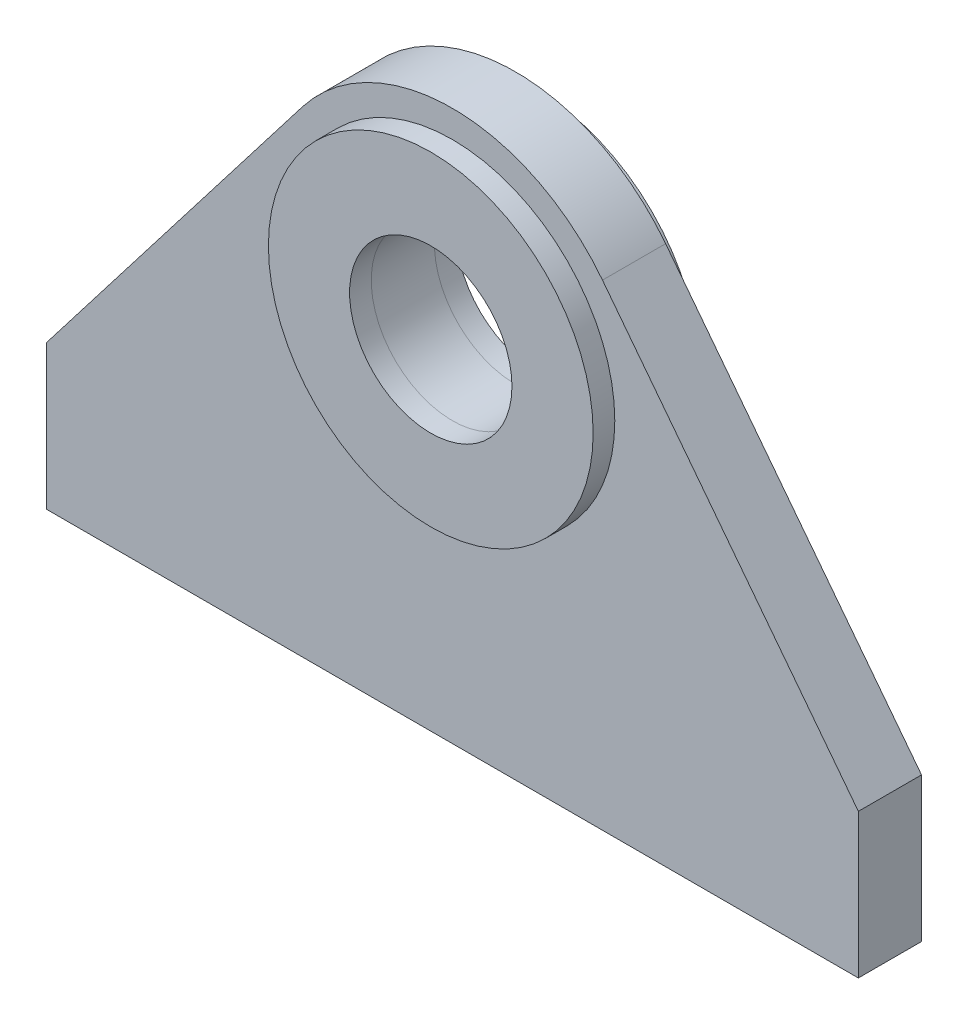
ISO-10303-21;
HEADER;
FILE_DESCRIPTION(('STEP AP214'),'2;1');
FILE_NAME('part.step','',(''),(''),'','','');
FILE_SCHEMA(('AUTOMOTIVE_DESIGN { 1 0 10303 214 1 1 1 1 }'));
ENDSEC;
DATA;
#1=APPLICATION_CONTEXT('core data for automotive mechanical design processes');
#2=APPLICATION_PROTOCOL_DEFINITION('international standard','automotive_design',2000,#1);
#3=PRODUCT_CONTEXT('',#1,'mechanical');
#4=PRODUCT('Part','Part','',(#3));
#5=PRODUCT_RELATED_PRODUCT_CATEGORY('part','',(#4));
#6=PRODUCT_DEFINITION_FORMATION('','',#4);
#7=PRODUCT_DEFINITION_CONTEXT('part definition',#1,'design');
#8=PRODUCT_DEFINITION('design','',#6,#7);
#9=PRODUCT_DEFINITION_SHAPE('','',#8);
#10=(LENGTH_UNIT() NAMED_UNIT(*) SI_UNIT(.MILLI.,.METRE.));
#11=(NAMED_UNIT(*) PLANE_ANGLE_UNIT() SI_UNIT($,.RADIAN.));
#12=(NAMED_UNIT(*) SI_UNIT($,.STERADIAN.) SOLID_ANGLE_UNIT());
#13=UNCERTAINTY_MEASURE_WITH_UNIT(LENGTH_MEASURE(1.E-05),#10,'distance_accuracy_value','');
#14=(GEOMETRIC_REPRESENTATION_CONTEXT(3) GLOBAL_UNCERTAINTY_ASSIGNED_CONTEXT((#13)) GLOBAL_UNIT_ASSIGNED_CONTEXT((#10,
#11,#12)) REPRESENTATION_CONTEXT('',''));
#15=CARTESIAN_POINT('',(0.,0.,0.));
#16=DIRECTION('',(0.,0.,1.));
#17=DIRECTION('',(1.,0.,0.));
#18=AXIS2_PLACEMENT_3D('',#15,#16,#17);
#19=CARTESIAN_POINT('',(0.,200.,-29.5));
#20=DIRECTION('',(0.,0.,-1.));
#21=DIRECTION('',(1.,0.,0.));
#22=AXIS2_PLACEMENT_3D('',#19,#20,#21);
#23=PLANE('',#22);
#24=CARTESIAN_POINT('',(0.,200.,-29.5));
#25=DIRECTION('',(0.,0.,1.));
#26=DIRECTION('',(1.,0.,0.));
#27=AXIS2_PLACEMENT_3D('',#24,#25,#26);
#28=CIRCLE('',#27,90.0000000000001);
#29=CARTESIAN_POINT('',(90.0000000000001,200.,-29.5));
#30=VERTEX_POINT('',#29);
#31=EDGE_CURVE('E11',#30,#30,#28,.T.);
#32=ORIENTED_EDGE('',*,*,#31,.F.);
#33=EDGE_LOOP('',(#32));
#34=FACE_BOUND('',#33,.T.);
#35=CARTESIAN_POINT('',(0.,200.,-29.5));
#36=DIRECTION('',(0.,0.,1.));
#37=DIRECTION('',(1.,0.,0.));
#38=AXIS2_PLACEMENT_3D('',#35,#36,#37);
#39=CIRCLE('',#38,45.);
#40=CARTESIAN_POINT('',(45.,200.,-29.5));
#41=VERTEX_POINT('',#40);
#42=EDGE_CURVE('E53',#41,#41,#39,.T.);
#43=ORIENTED_EDGE('',*,*,#42,.T.);
#44=EDGE_LOOP('',(#43));
#45=FACE_BOUND('',#44,.T.);
#46=ADVANCED_FACE('F42',(#34,#45),#23,.T.);
#47=CARTESIAN_POINT('',(0.,200.,-17.5));
#48=DIRECTION('',(0.,0.,-1.));
#49=DIRECTION('',(1.,0.,0.));
#50=AXIS2_PLACEMENT_3D('',#47,#48,#49);
#51=PLANE('',#50);
#52=CARTESIAN_POINT('',(0.,200.,-17.5));
#53=DIRECTION('',(0.,0.,1.));
#54=DIRECTION('',(1.,0.,0.));
#55=AXIS2_PLACEMENT_3D('',#52,#53,#54);
#56=CIRCLE('',#55,90.0000000000001);
#57=CARTESIAN_POINT('',(90.0000000000001,200.,-17.5));
#58=VERTEX_POINT('',#57);
#59=EDGE_CURVE('E46',#58,#58,#56,.T.);
#60=ORIENTED_EDGE('',*,*,#59,.T.);
#61=EDGE_LOOP('',(#60));
#62=FACE_BOUND('',#61,.T.);
#63=CARTESIAN_POINT('',(0.,200.,-17.5));
#64=DIRECTION('',(0.,0.,1.));
#65=DIRECTION('',(1.,0.,0.));
#66=AXIS2_PLACEMENT_3D('',#63,#64,#65);
#67=CIRCLE('',#66,45.);
#68=CARTESIAN_POINT('',(45.,200.,-17.5));
#69=VERTEX_POINT('',#68);
#70=EDGE_CURVE('E55',#69,#69,#67,.T.);
#71=ORIENTED_EDGE('',*,*,#70,.F.);
#72=EDGE_LOOP('',(#71));
#73=FACE_BOUND('',#72,.T.);
#74=ADVANCED_FACE('F68',(#62,#73),#51,.F.);
#75=CARTESIAN_POINT('',(0.,200.,-29.5));
#76=DIRECTION('',(0.,0.,1.));
#77=DIRECTION('',(-1.,0.,0.));
#78=AXIS2_PLACEMENT_3D('',#75,#76,#77);
#79=CYLINDRICAL_SURFACE('',#78,90.0000000000001);
#80=ORIENTED_EDGE('',*,*,#31,.T.);
#81=EDGE_LOOP('',(#80));
#82=FACE_BOUND('',#81,.T.);
#83=ORIENTED_EDGE('',*,*,#59,.F.);
#84=EDGE_LOOP('',(#83));
#85=FACE_BOUND('',#84,.T.);
#86=ADVANCED_FACE('F44',(#82,#85),#79,.T.);
#87=CARTESIAN_POINT('',(0.,200.,-29.5));
#88=DIRECTION('',(0.,0.,1.));
#89=DIRECTION('',(-1.,0.,0.));
#90=AXIS2_PLACEMENT_3D('',#87,#88,#89);
#91=CYLINDRICAL_SURFACE('',#90,45.);
#92=ORIENTED_EDGE('',*,*,#42,.F.);
#93=EDGE_LOOP('',(#92));
#94=FACE_BOUND('',#93,.T.);
#95=ORIENTED_EDGE('',*,*,#70,.T.);
#96=EDGE_LOOP('',(#95));
#97=FACE_BOUND('',#96,.T.);
#98=ADVANCED_FACE('F62',(#94,#97),#91,.F.);
#99=CLOSED_SHELL('',(#46,#74,#86,#98));
#100=MANIFOLD_SOLID_BREP('B2',#99);
#101=CARTESIAN_POINT('',(0.,200.,29.5));
#102=DIRECTION('',(0.,0.,1.));
#103=DIRECTION('',(1.,0.,0.));
#104=AXIS2_PLACEMENT_3D('',#101,#102,#103);
#105=PLANE('',#104);
#106=CARTESIAN_POINT('',(0.,200.,29.5));
#107=DIRECTION('',(0.,0.,1.));
#108=DIRECTION('',(1.,0.,0.));
#109=AXIS2_PLACEMENT_3D('',#106,#107,#108);
#110=CIRCLE('',#109,90.0000000000001);
#111=CARTESIAN_POINT('',(90.0000000000001,200.,29.5));
#112=VERTEX_POINT('',#111);
#113=EDGE_CURVE('E41',#112,#112,#110,.T.);
#114=ORIENTED_EDGE('',*,*,#113,.T.);
#115=EDGE_LOOP('',(#114));
#116=FACE_BOUND('',#115,.T.);
#117=CARTESIAN_POINT('',(0.,200.,29.5));
#118=DIRECTION('',(0.,0.,1.));
#119=DIRECTION('',(1.,0.,0.));
#120=AXIS2_PLACEMENT_3D('',#117,#118,#119);
#121=CIRCLE('',#120,45.);
#122=CARTESIAN_POINT('',(45.,200.,29.5));
#123=VERTEX_POINT('',#122);
#124=EDGE_CURVE('E124',#123,#123,#121,.T.);
#125=ORIENTED_EDGE('',*,*,#124,.F.);
#126=EDGE_LOOP('',(#125));
#127=FACE_BOUND('',#126,.T.);
#128=ADVANCED_FACE('F113',(#116,#127),#105,.T.);
#129=CARTESIAN_POINT('',(0.,200.,17.5));
#130=DIRECTION('',(0.,0.,1.));
#131=DIRECTION('',(1.,0.,0.));
#132=AXIS2_PLACEMENT_3D('',#129,#130,#131);
#133=PLANE('',#132);
#134=CARTESIAN_POINT('',(0.,200.,17.5));
#135=DIRECTION('',(0.,0.,1.));
#136=DIRECTION('',(1.,0.,0.));
#137=AXIS2_PLACEMENT_3D('',#134,#135,#136);
#138=CIRCLE('',#137,90.0000000000001);
#139=CARTESIAN_POINT('',(90.0000000000001,200.,17.5));
#140=VERTEX_POINT('',#139);
#141=EDGE_CURVE('E117',#140,#140,#138,.T.);
#142=ORIENTED_EDGE('',*,*,#141,.F.);
#143=EDGE_LOOP('',(#142));
#144=FACE_BOUND('',#143,.T.);
#145=CARTESIAN_POINT('',(0.,200.,17.5));
#146=DIRECTION('',(0.,0.,1.));
#147=DIRECTION('',(1.,0.,0.));
#148=AXIS2_PLACEMENT_3D('',#145,#146,#147);
#149=CIRCLE('',#148,45.);
#150=CARTESIAN_POINT('',(45.,200.,17.5));
#151=VERTEX_POINT('',#150);
#152=EDGE_CURVE('E126',#151,#151,#149,.T.);
#153=ORIENTED_EDGE('',*,*,#152,.T.);
#154=EDGE_LOOP('',(#153));
#155=FACE_BOUND('',#154,.T.);
#156=ADVANCED_FACE('F136',(#144,#155),#133,.F.);
#157=CARTESIAN_POINT('',(0.,200.,29.5));
#158=DIRECTION('',(0.,0.,-1.));
#159=DIRECTION('',(-1.,0.,0.));
#160=AXIS2_PLACEMENT_3D('',#157,#158,#159);
#161=CYLINDRICAL_SURFACE('',#160,90.0000000000001);
#162=ORIENTED_EDGE('',*,*,#113,.F.);
#163=EDGE_LOOP('',(#162));
#164=FACE_BOUND('',#163,.T.);
#165=ORIENTED_EDGE('',*,*,#141,.T.);
#166=EDGE_LOOP('',(#165));
#167=FACE_BOUND('',#166,.T.);
#168=ADVANCED_FACE('F115',(#164,#167),#161,.T.);
#169=CARTESIAN_POINT('',(0.,200.,29.5));
#170=DIRECTION('',(0.,0.,-1.));
#171=DIRECTION('',(-1.,0.,0.));
#172=AXIS2_PLACEMENT_3D('',#169,#170,#171);
#173=CYLINDRICAL_SURFACE('',#172,45.);
#174=ORIENTED_EDGE('',*,*,#124,.T.);
#175=EDGE_LOOP('',(#174));
#176=FACE_BOUND('',#175,.T.);
#177=ORIENTED_EDGE('',*,*,#152,.F.);
#178=EDGE_LOOP('',(#177));
#179=FACE_BOUND('',#178,.T.);
#180=ADVANCED_FACE('F132',(#176,#179),#173,.F.);
#181=CLOSED_SHELL('',(#128,#156,#168,#180));
#182=MANIFOLD_SOLID_BREP('B6',#181);
#183=CARTESIAN_POINT('',(0.,200.,17.5));
#184=DIRECTION('',(0.,0.,1.));
#185=DIRECTION('',(1.,0.,0.));
#186=AXIS2_PLACEMENT_3D('',#183,#184,#185);
#187=PLANE('',#186);
#188=DIRECTION('',(0.,-1.,0.));
#189=VECTOR('',#188,1.);
#190=CARTESIAN_POINT('',(-225.,0.,17.5));
#191=LINE('',#190,#189);
#192=CARTESIAN_POINT('',(-225.,80.,17.5));
#193=VERTEX_POINT('',#192);
#194=CARTESIAN_POINT('',(-225.,0.,17.5));
#195=VERTEX_POINT('',#194);
#196=EDGE_CURVE('E270',#193,#195,#191,.T.);
#197=ORIENTED_EDGE('',*,*,#196,.T.);
#198=DIRECTION('',(1.,0.,0.));
#199=VECTOR('',#198,1.);
#200=CARTESIAN_POINT('',(-225.,0.,17.5));
#201=LINE('',#200,#199);
#202=CARTESIAN_POINT('',(225.,0.,17.5));
#203=VERTEX_POINT('',#202);
#204=EDGE_CURVE('E228',#195,#203,#201,.T.);
#205=ORIENTED_EDGE('',*,*,#204,.T.);
#206=DIRECTION('',(0.,1.,0.));
#207=VECTOR('',#206,1.);
#208=CARTESIAN_POINT('',(225.,0.,17.5));
#209=LINE('',#208,#207);
#210=CARTESIAN_POINT('',(225.,80.,17.5));
#211=VERTEX_POINT('',#210);
#212=EDGE_CURVE('E241',#203,#211,#209,.T.);
#213=ORIENTED_EDGE('',*,*,#212,.T.);
#214=DIRECTION('',(-0.610307961150329,0.792164245946842,0.));
#215=VECTOR('',#214,1.);
#216=CARTESIAN_POINT('',(225.,80.,17.5));
#217=LINE('',#216,#215);
#218=CARTESIAN_POINT('',(83.1772458244184,264.082335920785,17.5));
#219=VERTEX_POINT('',#218);
#220=EDGE_CURVE('E235',#211,#219,#217,.T.);
#221=ORIENTED_EDGE('',*,*,#220,.T.);
#222=CARTESIAN_POINT('',(0.,200.,17.5));
#223=DIRECTION('',(0.,0.,1.));
#224=DIRECTION('',(1.,0.,0.));
#225=AXIS2_PLACEMENT_3D('',#222,#223,#224);
#226=CIRCLE('',#225,105.);
#227=CARTESIAN_POINT('',(-83.1772458244184,264.082335920785,17.5));
#228=VERTEX_POINT('',#227);
#229=EDGE_CURVE('E239',#219,#228,#226,.T.);
#230=ORIENTED_EDGE('',*,*,#229,.T.);
#231=DIRECTION('',(-0.610307961150329,-0.792164245946842,0.));
#232=VECTOR('',#231,1.);
#233=CARTESIAN_POINT('',(-225.,80.,17.5));
#234=LINE('',#233,#232);
#235=EDGE_CURVE('E191',#228,#193,#234,.T.);
#236=ORIENTED_EDGE('',*,*,#235,.T.);
#237=EDGE_LOOP('',(#197,#205,#213,#221,#230,#236));
#238=FACE_BOUND('',#237,.T.);
#239=CARTESIAN_POINT('',(0.,200.,17.5));
#240=DIRECTION('',(0.,0.,1.));
#241=DIRECTION('',(1.,0.,0.));
#242=AXIS2_PLACEMENT_3D('',#239,#240,#241);
#243=CIRCLE('',#242,45.);
#244=CARTESIAN_POINT('',(45.,200.,17.5));
#245=VERTEX_POINT('',#244);
#246=EDGE_CURVE('E263',#245,#245,#243,.T.);
#247=ORIENTED_EDGE('',*,*,#246,.F.);
#248=EDGE_LOOP('',(#247));
#249=FACE_BOUND('',#248,.T.);
#250=ADVANCED_FACE('F174',(#238,#249),#187,.T.);
#251=CARTESIAN_POINT('',(0.,200.,-17.5));
#252=DIRECTION('',(0.,0.,1.));
#253=DIRECTION('',(1.,0.,0.));
#254=AXIS2_PLACEMENT_3D('',#251,#252,#253);
#255=PLANE('',#254);
#256=DIRECTION('',(0.,-1.,0.));
#257=VECTOR('',#256,1.);
#258=CARTESIAN_POINT('',(-225.,0.,-17.5));
#259=LINE('',#258,#257);
#260=CARTESIAN_POINT('',(-225.,80.,-17.5));
#261=VERTEX_POINT('',#260);
#262=CARTESIAN_POINT('',(-225.,0.,-17.5));
#263=VERTEX_POINT('',#262);
#264=EDGE_CURVE('E259',#261,#263,#259,.T.);
#265=ORIENTED_EDGE('',*,*,#264,.F.);
#266=DIRECTION('',(-0.610307961150329,-0.792164245946842,0.));
#267=VECTOR('',#266,1.);
#268=CARTESIAN_POINT('',(-225.,80.,-17.5));
#269=LINE('',#268,#267);
#270=CARTESIAN_POINT('',(-83.1772458244184,264.082335920785,-17.5));
#271=VERTEX_POINT('',#270);
#272=EDGE_CURVE('E220',#271,#261,#269,.T.);
#273=ORIENTED_EDGE('',*,*,#272,.F.);
#274=CARTESIAN_POINT('',(0.,200.,-17.5));
#275=DIRECTION('',(0.,0.,1.));
#276=DIRECTION('',(1.,0.,0.));
#277=AXIS2_PLACEMENT_3D('',#274,#275,#276);
#278=CIRCLE('',#277,105.);
#279=CARTESIAN_POINT('',(83.1772458244184,264.082335920785,-17.5));
#280=VERTEX_POINT('',#279);
#281=EDGE_CURVE('E214',#280,#271,#278,.T.);
#282=ORIENTED_EDGE('',*,*,#281,.F.);
#283=DIRECTION('',(-0.610307961150329,0.792164245946842,0.));
#284=VECTOR('',#283,1.);
#285=CARTESIAN_POINT('',(225.,80.,-17.5));
#286=LINE('',#285,#284);
#287=CARTESIAN_POINT('',(225.,80.,-17.5));
#288=VERTEX_POINT('',#287);
#289=EDGE_CURVE('E249',#288,#280,#286,.T.);
#290=ORIENTED_EDGE('',*,*,#289,.F.);
#291=DIRECTION('',(0.,1.,0.));
#292=VECTOR('',#291,1.);
#293=CARTESIAN_POINT('',(225.,0.,-17.5));
#294=LINE('',#293,#292);
#295=CARTESIAN_POINT('',(225.,0.,-17.5));
#296=VERTEX_POINT('',#295);
#297=EDGE_CURVE('E265',#296,#288,#294,.T.);
#298=ORIENTED_EDGE('',*,*,#297,.F.);
#299=DIRECTION('',(1.,0.,0.));
#300=VECTOR('',#299,1.);
#301=CARTESIAN_POINT('',(-225.,0.,-17.5));
#302=LINE('',#301,#300);
#303=EDGE_CURVE('E262',#263,#296,#302,.T.);
#304=ORIENTED_EDGE('',*,*,#303,.F.);
#305=EDGE_LOOP('',(#265,#273,#282,#290,#298,#304));
#306=FACE_BOUND('',#305,.T.);
#307=CARTESIAN_POINT('',(0.,200.,-17.5));
#308=DIRECTION('',(0.,0.,1.));
#309=DIRECTION('',(1.,0.,0.));
#310=AXIS2_PLACEMENT_3D('',#307,#308,#309);
#311=CIRCLE('',#310,45.);
#312=CARTESIAN_POINT('',(45.,200.,-17.5));
#313=VERTEX_POINT('',#312);
#314=EDGE_CURVE('E363',#313,#313,#311,.T.);
#315=ORIENTED_EDGE('',*,*,#314,.T.);
#316=EDGE_LOOP('',(#315));
#317=FACE_BOUND('',#316,.T.);
#318=ADVANCED_FACE('F279',(#306,#317),#255,.F.);
#319=CARTESIAN_POINT('',(-225.,0.,17.5));
#320=DIRECTION('',(1.,0.,0.));
#321=DIRECTION('',(0.,0.,-1.));
#322=AXIS2_PLACEMENT_3D('',#319,#320,#321);
#323=PLANE('',#322);
#324=ORIENTED_EDGE('',*,*,#264,.T.);
#325=DIRECTION('',(0.,0.,-1.));
#326=VECTOR('',#325,1.);
#327=CARTESIAN_POINT('',(-225.,0.,17.5));
#328=LINE('',#327,#326);
#329=EDGE_CURVE('E111',#195,#263,#328,.T.);
#330=ORIENTED_EDGE('',*,*,#329,.F.);
#331=ORIENTED_EDGE('',*,*,#196,.F.);
#332=DIRECTION('',(0.,0.,-1.));
#333=VECTOR('',#332,1.);
#334=CARTESIAN_POINT('',(-225.,80.,17.5));
#335=LINE('',#334,#333);
#336=EDGE_CURVE('E255',#193,#261,#335,.T.);
#337=ORIENTED_EDGE('',*,*,#336,.T.);
#338=EDGE_LOOP('',(#324,#330,#331,#337));
#339=FACE_BOUND('',#338,.T.);
#340=ADVANCED_FACE('F176',(#339),#323,.F.);
#341=CARTESIAN_POINT('',(-225.,0.,17.5));
#342=DIRECTION('',(0.,1.,0.));
#343=DIRECTION('',(0.,0.,1.));
#344=AXIS2_PLACEMENT_3D('',#341,#342,#343);
#345=PLANE('',#344);
#346=ORIENTED_EDGE('',*,*,#303,.T.);
#347=DIRECTION('',(0.,0.,-1.));
#348=VECTOR('',#347,1.);
#349=CARTESIAN_POINT('',(225.,0.,17.5));
#350=LINE('',#349,#348);
#351=EDGE_CURVE('E183',#203,#296,#350,.T.);
#352=ORIENTED_EDGE('',*,*,#351,.F.);
#353=ORIENTED_EDGE('',*,*,#204,.F.);
#354=ORIENTED_EDGE('',*,*,#329,.T.);
#355=EDGE_LOOP('',(#346,#352,#353,#354));
#356=FACE_BOUND('',#355,.T.);
#357=ADVANCED_FACE('F304',(#356),#345,.F.);
#358=CARTESIAN_POINT('',(225.,0.,17.5));
#359=DIRECTION('',(-1.,0.,0.));
#360=DIRECTION('',(0.,0.,1.));
#361=AXIS2_PLACEMENT_3D('',#358,#359,#360);
#362=PLANE('',#361);
#363=ORIENTED_EDGE('',*,*,#297,.T.);
#364=DIRECTION('',(0.,0.,-1.));
#365=VECTOR('',#364,1.);
#366=CARTESIAN_POINT('',(225.,80.,17.5));
#367=LINE('',#366,#365);
#368=EDGE_CURVE('E250',#211,#288,#367,.T.);
#369=ORIENTED_EDGE('',*,*,#368,.F.);
#370=ORIENTED_EDGE('',*,*,#212,.F.);
#371=ORIENTED_EDGE('',*,*,#351,.T.);
#372=EDGE_LOOP('',(#363,#369,#370,#371));
#373=FACE_BOUND('',#372,.T.);
#374=ADVANCED_FACE('F276',(#373),#362,.F.);
#375=CARTESIAN_POINT('',(225.,80.,17.5));
#376=DIRECTION('',(-0.792164245946842,-0.610307961150329,0.));
#377=DIRECTION('',(0.610307961150329,-0.792164245946842,0.));
#378=AXIS2_PLACEMENT_3D('',#375,#376,#377);
#379=PLANE('',#378);
#380=ORIENTED_EDGE('',*,*,#289,.T.);
#381=DIRECTION('',(0.,0.,-1.));
#382=VECTOR('',#381,1.);
#383=CARTESIAN_POINT('',(83.1772458244184,264.082335920785,17.5));
#384=LINE('',#383,#382);
#385=EDGE_CURVE('E246',#219,#280,#384,.T.);
#386=ORIENTED_EDGE('',*,*,#385,.F.);
#387=ORIENTED_EDGE('',*,*,#220,.F.);
#388=ORIENTED_EDGE('',*,*,#368,.T.);
#389=EDGE_LOOP('',(#380,#386,#387,#388));
#390=FACE_BOUND('',#389,.T.);
#391=ADVANCED_FACE('F247',(#390),#379,.F.);
#392=CARTESIAN_POINT('',(0.,200.,17.5));
#393=DIRECTION('',(0.,0.,-1.));
#394=DIRECTION('',(-1.,0.,0.));
#395=AXIS2_PLACEMENT_3D('',#392,#393,#394);
#396=CYLINDRICAL_SURFACE('',#395,105.);
#397=ORIENTED_EDGE('',*,*,#281,.T.);
#398=DIRECTION('',(0.,0.,-1.));
#399=VECTOR('',#398,1.);
#400=CARTESIAN_POINT('',(-83.1772458244184,264.082335920785,17.5));
#401=LINE('',#400,#399);
#402=EDGE_CURVE('E251',#228,#271,#401,.T.);
#403=ORIENTED_EDGE('',*,*,#402,.F.);
#404=ORIENTED_EDGE('',*,*,#229,.F.);
#405=ORIENTED_EDGE('',*,*,#385,.T.);
#406=EDGE_LOOP('',(#397,#403,#404,#405));
#407=FACE_BOUND('',#406,.T.);
#408=ADVANCED_FACE('F253',(#407),#396,.T.);
#409=CARTESIAN_POINT('',(-225.,80.,17.5));
#410=DIRECTION('',(0.792164245946842,-0.610307961150329,0.));
#411=DIRECTION('',(0.610307961150329,0.792164245946842,0.));
#412=AXIS2_PLACEMENT_3D('',#409,#410,#411);
#413=PLANE('',#412);
#414=ORIENTED_EDGE('',*,*,#272,.T.);
#415=ORIENTED_EDGE('',*,*,#336,.F.);
#416=ORIENTED_EDGE('',*,*,#235,.F.);
#417=ORIENTED_EDGE('',*,*,#402,.T.);
#418=EDGE_LOOP('',(#414,#415,#416,#417));
#419=FACE_BOUND('',#418,.T.);
#420=ADVANCED_FACE('F284',(#419),#413,.F.);
#421=CARTESIAN_POINT('',(0.,200.,17.5));
#422=DIRECTION('',(0.,0.,-1.));
#423=DIRECTION('',(-1.,0.,0.));
#424=AXIS2_PLACEMENT_3D('',#421,#422,#423);
#425=CYLINDRICAL_SURFACE('',#424,45.);
#426=ORIENTED_EDGE('',*,*,#246,.T.);
#427=EDGE_LOOP('',(#426));
#428=FACE_BOUND('',#427,.T.);
#429=ORIENTED_EDGE('',*,*,#314,.F.);
#430=EDGE_LOOP('',(#429));
#431=FACE_BOUND('',#430,.T.);
#432=ADVANCED_FACE('F286',(#428,#431),#425,.F.);
#433=CLOSED_SHELL('',(#250,#318,#340,#357,#374,#391,#408,#420,#432));
#434=MANIFOLD_SOLID_BREP('B36',#433);
#435=ADVANCED_BREP_SHAPE_REPRESENTATION('',(#18,#100,#182,#434),#14);
#436=SHAPE_DEFINITION_REPRESENTATION(#9,#435);
ENDSEC;
END-ISO-10303-21;
